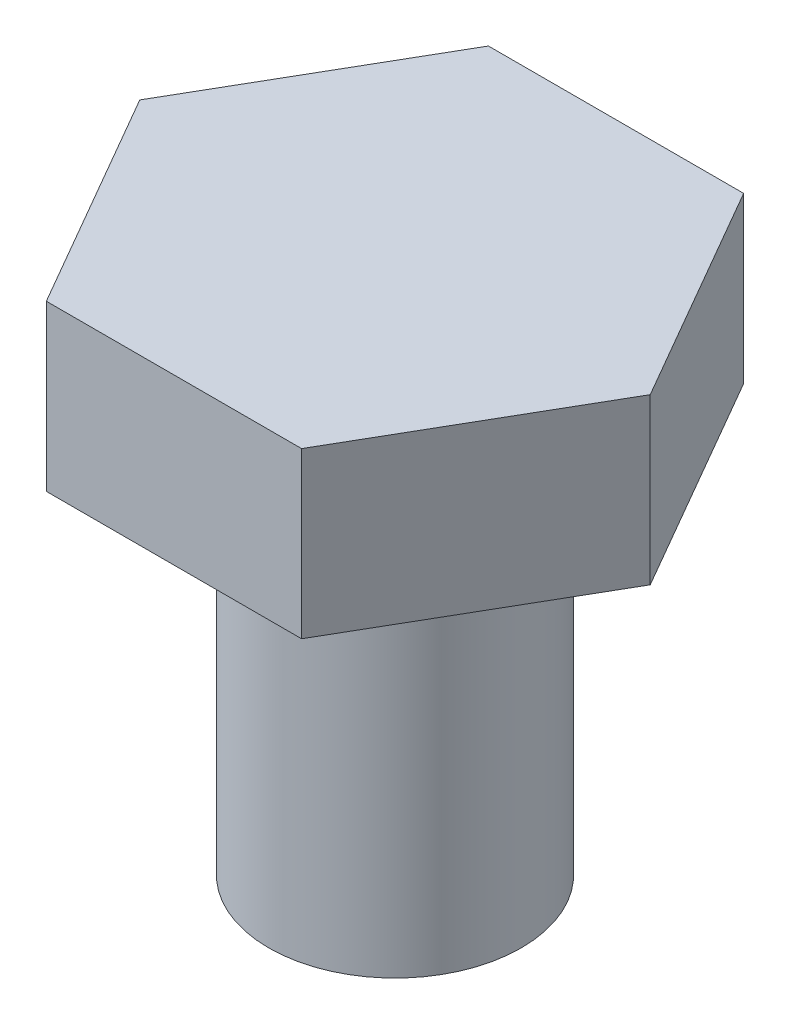
ISO-10303-21;
HEADER;
FILE_DESCRIPTION(('STEP AP214'),'2;1');
FILE_NAME('part.step','',(''),(''),'','','');
FILE_SCHEMA(('AUTOMOTIVE_DESIGN { 1 0 10303 214 1 1 1 1 }'));
ENDSEC;
DATA;
#1=APPLICATION_CONTEXT('core data for automotive mechanical design processes');
#2=APPLICATION_PROTOCOL_DEFINITION('international standard','automotive_design',2000,#1);
#3=PRODUCT_CONTEXT('',#1,'mechanical');
#4=PRODUCT('Part','Part','',(#3));
#5=PRODUCT_RELATED_PRODUCT_CATEGORY('part','',(#4));
#6=PRODUCT_DEFINITION_FORMATION('','',#4);
#7=PRODUCT_DEFINITION_CONTEXT('part definition',#1,'design');
#8=PRODUCT_DEFINITION('design','',#6,#7);
#9=PRODUCT_DEFINITION_SHAPE('','',#8);
#10=(LENGTH_UNIT() NAMED_UNIT(*) SI_UNIT(.MILLI.,.METRE.));
#11=(NAMED_UNIT(*) PLANE_ANGLE_UNIT() SI_UNIT($,.RADIAN.));
#12=(NAMED_UNIT(*) SI_UNIT($,.STERADIAN.) SOLID_ANGLE_UNIT());
#13=UNCERTAINTY_MEASURE_WITH_UNIT(LENGTH_MEASURE(1.E-05),#10,'distance_accuracy_value','');
#14=(GEOMETRIC_REPRESENTATION_CONTEXT(3) GLOBAL_UNCERTAINTY_ASSIGNED_CONTEXT((#13)) GLOBAL_UNIT_ASSIGNED_CONTEXT((#10,
#11,#12)) REPRESENTATION_CONTEXT('',''));
#15=CARTESIAN_POINT('',(0.,0.,0.));
#16=DIRECTION('',(0.,0.,1.));
#17=DIRECTION('',(1.,0.,0.));
#18=AXIS2_PLACEMENT_3D('',#15,#16,#17);
#19=CARTESIAN_POINT('',(0.,-9.525,0.));
#20=DIRECTION('',(0.,1.,0.));
#21=DIRECTION('',(0.,0.,1.));
#22=AXIS2_PLACEMENT_3D('',#19,#20,#21);
#23=CYLINDRICAL_SURFACE('',#22,3.175);
#24=CARTESIAN_POINT('',(0.,-9.525,0.));
#25=DIRECTION('',(0.,1.,0.));
#26=DIRECTION('',(0.,0.,1.));
#27=AXIS2_PLACEMENT_3D('',#24,#25,#26);
#28=CIRCLE('',#27,3.175);
#29=CARTESIAN_POINT('',(0.,-9.525,3.175));
#30=VERTEX_POINT('',#29);
#31=EDGE_CURVE('E11',#30,#30,#28,.T.);
#32=ORIENTED_EDGE('',*,*,#31,.T.);
#33=EDGE_LOOP('',(#32));
#34=FACE_BOUND('',#33,.T.);
#35=CARTESIAN_POINT('',(0.,0.,0.));
#36=DIRECTION('',(0.,1.,0.));
#37=DIRECTION('',(0.,0.,1.));
#38=AXIS2_PLACEMENT_3D('',#35,#36,#37);
#39=CIRCLE('',#38,3.175);
#40=CARTESIAN_POINT('',(0.,0.,3.175));
#41=VERTEX_POINT('',#40);
#42=EDGE_CURVE('E36',#41,#41,#39,.T.);
#43=ORIENTED_EDGE('',*,*,#42,.F.);
#44=EDGE_LOOP('',(#43));
#45=FACE_BOUND('',#44,.T.);
#46=ADVANCED_FACE('F33',(#34,#45),#23,.T.);
#47=CARTESIAN_POINT('',(0.,-9.525,0.));
#48=DIRECTION('',(0.,1.,0.));
#49=DIRECTION('',(0.,0.,1.));
#50=AXIS2_PLACEMENT_3D('',#47,#48,#49);
#51=PLANE('',#50);
#52=ORIENTED_EDGE('',*,*,#31,.F.);
#53=EDGE_LOOP('',(#52));
#54=FACE_BOUND('',#53,.T.);
#55=ADVANCED_FACE('F144',(#54),#51,.F.);
#56=CARTESIAN_POINT('',(-6.41580486636972,4.1402,0.));
#57=DIRECTION('',(0.866025403784439,0.,0.5));
#58=DIRECTION('',(0.5,0.,-0.866025403784439));
#59=AXIS2_PLACEMENT_3D('',#56,#57,#58);
#60=PLANE('',#59);
#61=DIRECTION('',(-0.5,0.,0.866025403784438));
#62=VECTOR('',#61,1.);
#63=CARTESIAN_POINT('',(-6.41580486636972,0.,0.));
#64=LINE('',#63,#62);
#65=CARTESIAN_POINT('',(-3.20790243318486,0.,-5.55625));
#66=VERTEX_POINT('',#65);
#67=CARTESIAN_POINT('',(-6.41580486636972,0.,0.));
#68=VERTEX_POINT('',#67);
#69=EDGE_CURVE('E118',#66,#68,#64,.T.);
#70=ORIENTED_EDGE('',*,*,#69,.T.);
#71=DIRECTION('',(0.,-1.,0.));
#72=VECTOR('',#71,1.);
#73=CARTESIAN_POINT('',(-6.41580486636972,4.1402,0.));
#74=LINE('',#73,#72);
#75=CARTESIAN_POINT('',(-6.41580486636972,4.1402,0.));
#76=VERTEX_POINT('',#75);
#77=EDGE_CURVE('E135',#76,#68,#74,.T.);
#78=ORIENTED_EDGE('',*,*,#77,.F.);
#79=DIRECTION('',(-0.5,0.,0.866025403784438));
#80=VECTOR('',#79,1.);
#81=CARTESIAN_POINT('',(-6.41580486636972,4.1402,0.));
#82=LINE('',#81,#80);
#83=CARTESIAN_POINT('',(-3.20790243318486,4.1402,-5.55625));
#84=VERTEX_POINT('',#83);
#85=EDGE_CURVE('E128',#84,#76,#82,.T.);
#86=ORIENTED_EDGE('',*,*,#85,.F.);
#87=DIRECTION('',(0.,-1.,0.));
#88=VECTOR('',#87,1.);
#89=CARTESIAN_POINT('',(-3.20790243318486,4.1402,-5.55625));
#90=LINE('',#89,#88);
#91=EDGE_CURVE('E114',#84,#66,#90,.T.);
#92=ORIENTED_EDGE('',*,*,#91,.T.);
#93=EDGE_LOOP('',(#70,#78,#86,#92));
#94=FACE_BOUND('',#93,.T.);
#95=ADVANCED_FACE('F149',(#94),#60,.F.);
#96=CARTESIAN_POINT('',(-3.20790243318486,4.1402,5.55625));
#97=DIRECTION('',(0.866025403784439,0.,-0.5));
#98=DIRECTION('',(-0.5,0.,-0.866025403784439));
#99=AXIS2_PLACEMENT_3D('',#96,#97,#98);
#100=PLANE('',#99);
#101=DIRECTION('',(0.5,0.,0.866025403784439));
#102=VECTOR('',#101,1.);
#103=CARTESIAN_POINT('',(-3.20790243318486,0.,5.55625));
#104=LINE('',#103,#102);
#105=CARTESIAN_POINT('',(-3.20790243318486,0.,5.55625));
#106=VERTEX_POINT('',#105);
#107=EDGE_CURVE('E121',#68,#106,#104,.T.);
#108=ORIENTED_EDGE('',*,*,#107,.T.);
#109=DIRECTION('',(0.,-1.,0.));
#110=VECTOR('',#109,1.);
#111=CARTESIAN_POINT('',(-3.20790243318486,4.1402,5.55625));
#112=LINE('',#111,#110);
#113=CARTESIAN_POINT('',(-3.20790243318486,4.1402,5.55625));
#114=VERTEX_POINT('',#113);
#115=EDGE_CURVE('E132',#114,#106,#112,.T.);
#116=ORIENTED_EDGE('',*,*,#115,.F.);
#117=DIRECTION('',(0.5,0.,0.866025403784439));
#118=VECTOR('',#117,1.);
#119=CARTESIAN_POINT('',(-3.20790243318486,4.1402,5.55625));
#120=LINE('',#119,#118);
#121=EDGE_CURVE('E87',#76,#114,#120,.T.);
#122=ORIENTED_EDGE('',*,*,#121,.F.);
#123=ORIENTED_EDGE('',*,*,#77,.T.);
#124=EDGE_LOOP('',(#108,#116,#122,#123));
#125=FACE_BOUND('',#124,.T.);
#126=ADVANCED_FACE('F155',(#125),#100,.F.);
#127=CARTESIAN_POINT('',(3.20790243318486,4.1402,5.55625));
#128=DIRECTION('',(0.,0.,-1.));
#129=DIRECTION('',(-1.,0.,0.));
#130=AXIS2_PLACEMENT_3D('',#127,#128,#129);
#131=PLANE('',#130);
#132=DIRECTION('',(1.,0.,0.));
#133=VECTOR('',#132,1.);
#134=CARTESIAN_POINT('',(3.20790243318486,0.,5.55625));
#135=LINE('',#134,#133);
#136=CARTESIAN_POINT('',(3.20790243318486,0.,5.55625));
#137=VERTEX_POINT('',#136);
#138=EDGE_CURVE('E123',#106,#137,#135,.T.);
#139=ORIENTED_EDGE('',*,*,#138,.T.);
#140=DIRECTION('',(0.,-1.,0.));
#141=VECTOR('',#140,1.);
#142=CARTESIAN_POINT('',(3.20790243318486,4.1402,5.55625));
#143=LINE('',#142,#141);
#144=CARTESIAN_POINT('',(3.20790243318486,4.1402,5.55625));
#145=VERTEX_POINT('',#144);
#146=EDGE_CURVE('E109',#145,#137,#143,.T.);
#147=ORIENTED_EDGE('',*,*,#146,.F.);
#148=DIRECTION('',(1.,0.,0.));
#149=VECTOR('',#148,1.);
#150=CARTESIAN_POINT('',(3.20790243318486,4.1402,5.55625));
#151=LINE('',#150,#149);
#152=EDGE_CURVE('E100',#114,#145,#151,.T.);
#153=ORIENTED_EDGE('',*,*,#152,.F.);
#154=ORIENTED_EDGE('',*,*,#115,.T.);
#155=EDGE_LOOP('',(#139,#147,#153,#154));
#156=FACE_BOUND('',#155,.T.);
#157=ADVANCED_FACE('F161',(#156),#131,.F.);
#158=CARTESIAN_POINT('',(6.41580486636972,4.1402,0.));
#159=DIRECTION('',(-0.866025403784439,0.,-0.5));
#160=DIRECTION('',(-0.5,0.,0.866025403784439));
#161=AXIS2_PLACEMENT_3D('',#158,#159,#160);
#162=PLANE('',#161);
#163=DIRECTION('',(0.5,0.,-0.866025403784439));
#164=VECTOR('',#163,1.);
#165=CARTESIAN_POINT('',(6.41580486636972,0.,0.));
#166=LINE('',#165,#164);
#167=CARTESIAN_POINT('',(6.41580486636972,0.,0.));
#168=VERTEX_POINT('',#167);
#169=EDGE_CURVE('E108',#137,#168,#166,.T.);
#170=ORIENTED_EDGE('',*,*,#169,.T.);
#171=DIRECTION('',(0.,-1.,0.));
#172=VECTOR('',#171,1.);
#173=CARTESIAN_POINT('',(6.41580486636972,4.1402,0.));
#174=LINE('',#173,#172);
#175=CARTESIAN_POINT('',(6.41580486636972,4.1402,0.));
#176=VERTEX_POINT('',#175);
#177=EDGE_CURVE('E105',#176,#168,#174,.T.);
#178=ORIENTED_EDGE('',*,*,#177,.F.);
#179=DIRECTION('',(0.5,0.,-0.866025403784439));
#180=VECTOR('',#179,1.);
#181=CARTESIAN_POINT('',(6.41580486636972,4.1402,0.));
#182=LINE('',#181,#180);
#183=EDGE_CURVE('E94',#145,#176,#182,.T.);
#184=ORIENTED_EDGE('',*,*,#183,.F.);
#185=ORIENTED_EDGE('',*,*,#146,.T.);
#186=EDGE_LOOP('',(#170,#178,#184,#185));
#187=FACE_BOUND('',#186,.T.);
#188=ADVANCED_FACE('F106',(#187),#162,.F.);
#189=CARTESIAN_POINT('',(3.20790243318486,4.1402,-5.55625));
#190=DIRECTION('',(-0.866025403784439,0.,0.5));
#191=DIRECTION('',(0.5,0.,0.866025403784439));
#192=AXIS2_PLACEMENT_3D('',#189,#190,#191);
#193=PLANE('',#192);
#194=DIRECTION('',(-0.5,0.,-0.866025403784438));
#195=VECTOR('',#194,1.);
#196=CARTESIAN_POINT('',(3.20790243318486,0.,-5.55625));
#197=LINE('',#196,#195);
#198=CARTESIAN_POINT('',(3.20790243318486,0.,-5.55625));
#199=VERTEX_POINT('',#198);
#200=EDGE_CURVE('E72',#168,#199,#197,.T.);
#201=ORIENTED_EDGE('',*,*,#200,.T.);
#202=DIRECTION('',(0.,-1.,0.));
#203=VECTOR('',#202,1.);
#204=CARTESIAN_POINT('',(3.20790243318486,4.1402,-5.55625));
#205=LINE('',#204,#203);
#206=CARTESIAN_POINT('',(3.20790243318486,4.1402,-5.55625));
#207=VERTEX_POINT('',#206);
#208=EDGE_CURVE('E110',#207,#199,#205,.T.);
#209=ORIENTED_EDGE('',*,*,#208,.F.);
#210=DIRECTION('',(-0.5,0.,-0.866025403784438));
#211=VECTOR('',#210,1.);
#212=CARTESIAN_POINT('',(3.20790243318486,4.1402,-5.55625));
#213=LINE('',#212,#211);
#214=EDGE_CURVE('E98',#176,#207,#213,.T.);
#215=ORIENTED_EDGE('',*,*,#214,.F.);
#216=ORIENTED_EDGE('',*,*,#177,.T.);
#217=EDGE_LOOP('',(#201,#209,#215,#216));
#218=FACE_BOUND('',#217,.T.);
#219=ADVANCED_FACE('F112',(#218),#193,.F.);
#220=CARTESIAN_POINT('',(-3.20790243318486,4.1402,-5.55625));
#221=DIRECTION('',(0.,0.,1.));
#222=DIRECTION('',(1.,0.,0.));
#223=AXIS2_PLACEMENT_3D('',#220,#221,#222);
#224=PLANE('',#223);
#225=DIRECTION('',(-1.,0.,0.));
#226=VECTOR('',#225,1.);
#227=CARTESIAN_POINT('',(-3.20790243318486,0.,-5.55625));
#228=LINE('',#227,#226);
#229=EDGE_CURVE('E78',#199,#66,#228,.T.);
#230=ORIENTED_EDGE('',*,*,#229,.T.);
#231=ORIENTED_EDGE('',*,*,#91,.F.);
#232=DIRECTION('',(-1.,0.,0.));
#233=VECTOR('',#232,1.);
#234=CARTESIAN_POINT('',(-3.20790243318486,4.1402,-5.55625));
#235=LINE('',#234,#233);
#236=EDGE_CURVE('E49',#207,#84,#235,.T.);
#237=ORIENTED_EDGE('',*,*,#236,.F.);
#238=ORIENTED_EDGE('',*,*,#208,.T.);
#239=EDGE_LOOP('',(#230,#231,#237,#238));
#240=FACE_BOUND('',#239,.T.);
#241=ADVANCED_FACE('F169',(#240),#224,.F.);
#242=CARTESIAN_POINT('',(0.,4.1402,0.));
#243=DIRECTION('',(0.,-1.,0.));
#244=DIRECTION('',(0.,0.,-1.));
#245=AXIS2_PLACEMENT_3D('',#242,#243,#244);
#246=PLANE('',#245);
#247=ORIENTED_EDGE('',*,*,#85,.T.);
#248=ORIENTED_EDGE('',*,*,#121,.T.);
#249=ORIENTED_EDGE('',*,*,#152,.T.);
#250=ORIENTED_EDGE('',*,*,#183,.T.);
#251=ORIENTED_EDGE('',*,*,#214,.T.);
#252=ORIENTED_EDGE('',*,*,#236,.T.);
#253=EDGE_LOOP('',(#247,#248,#249,#250,#251,#252));
#254=FACE_BOUND('',#253,.T.);
#255=ADVANCED_FACE('F96',(#254),#246,.F.);
#256=CARTESIAN_POINT('',(0.,0.,0.));
#257=DIRECTION('',(0.,-1.,0.));
#258=DIRECTION('',(0.,0.,-1.));
#259=AXIS2_PLACEMENT_3D('',#256,#257,#258);
#260=PLANE('',#259);
#261=ORIENTED_EDGE('',*,*,#42,.T.);
#262=EDGE_LOOP('',(#261));
#263=FACE_BOUND('',#262,.T.);
#264=ORIENTED_EDGE('',*,*,#69,.F.);
#265=ORIENTED_EDGE('',*,*,#229,.F.);
#266=ORIENTED_EDGE('',*,*,#200,.F.);
#267=ORIENTED_EDGE('',*,*,#169,.F.);
#268=ORIENTED_EDGE('',*,*,#138,.F.);
#269=ORIENTED_EDGE('',*,*,#107,.F.);
#270=EDGE_LOOP('',(#264,#265,#266,#267,#268,#269));
#271=FACE_BOUND('',#270,.T.);
#272=ADVANCED_FACE('F140',(#263,#271),#260,.T.);
#273=CLOSED_SHELL('',(#46,#55,#95,#126,#157,#188,#219,#241,#255,#272));
#274=MANIFOLD_SOLID_BREP('B2',#273);
#275=ADVANCED_BREP_SHAPE_REPRESENTATION('',(#18,#274),#14);
#276=SHAPE_DEFINITION_REPRESENTATION(#9,#275);
ENDSEC;
END-ISO-10303-21;
